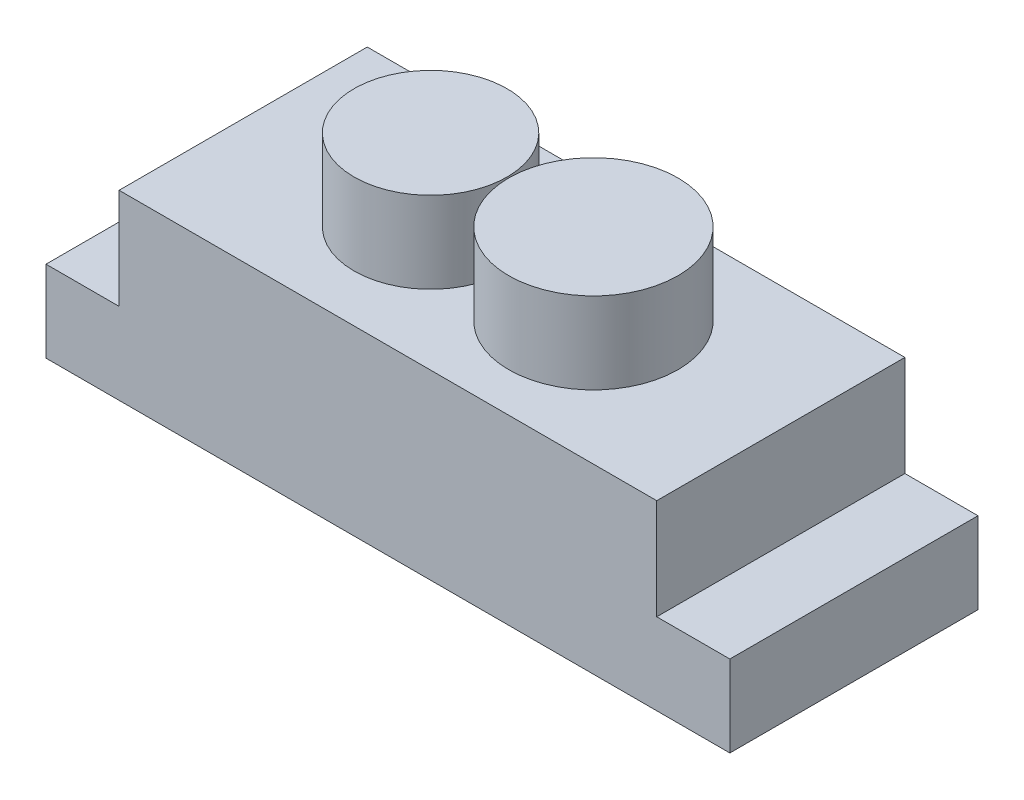
ISO-10303-21;
HEADER;
FILE_DESCRIPTION(('STEP AP214'),'2;1');
FILE_NAME('part.step','',(''),(''),'','','');
FILE_SCHEMA(('AUTOMOTIVE_DESIGN { 1 0 10303 214 1 1 1 1 }'));
ENDSEC;
DATA;
#1=APPLICATION_CONTEXT('core data for automotive mechanical design processes');
#2=APPLICATION_PROTOCOL_DEFINITION('international standard','automotive_design',2000,#1);
#3=PRODUCT_CONTEXT('',#1,'mechanical');
#4=PRODUCT('Part','Part','',(#3));
#5=PRODUCT_RELATED_PRODUCT_CATEGORY('part','',(#4));
#6=PRODUCT_DEFINITION_FORMATION('','',#4);
#7=PRODUCT_DEFINITION_CONTEXT('part definition',#1,'design');
#8=PRODUCT_DEFINITION('design','',#6,#7);
#9=PRODUCT_DEFINITION_SHAPE('','',#8);
#10=(LENGTH_UNIT() NAMED_UNIT(*) SI_UNIT(.MILLI.,.METRE.));
#11=(NAMED_UNIT(*) PLANE_ANGLE_UNIT() SI_UNIT($,.RADIAN.));
#12=(NAMED_UNIT(*) SI_UNIT($,.STERADIAN.) SOLID_ANGLE_UNIT());
#13=UNCERTAINTY_MEASURE_WITH_UNIT(LENGTH_MEASURE(1.E-05),#10,'distance_accuracy_value','');
#14=(GEOMETRIC_REPRESENTATION_CONTEXT(3) GLOBAL_UNCERTAINTY_ASSIGNED_CONTEXT((#13)) GLOBAL_UNIT_ASSIGNED_CONTEXT((#10,
#11,#12)) REPRESENTATION_CONTEXT('',''));
#15=CARTESIAN_POINT('',(0.,0.,0.));
#16=DIRECTION('',(0.,0.,1.));
#17=DIRECTION('',(1.,0.,0.));
#18=AXIS2_PLACEMENT_3D('',#15,#16,#17);
#19=CARTESIAN_POINT('',(-16.51,11.176,7.62));
#20=DIRECTION('',(1.,0.,0.));
#21=DIRECTION('',(0.,0.,-1.));
#22=AXIS2_PLACEMENT_3D('',#19,#20,#21);
#23=PLANE('',#22);
#24=DIRECTION('',(0.,0.,-1.));
#25=VECTOR('',#24,1.);
#26=CARTESIAN_POINT('',(-16.51,5.,7.62));
#27=LINE('',#26,#25);
#28=CARTESIAN_POINT('',(-16.51,5.,7.62));
#29=VERTEX_POINT('',#28);
#30=CARTESIAN_POINT('',(-16.51,5.,-7.62));
#31=VERTEX_POINT('',#30);
#32=EDGE_CURVE('E54',#29,#31,#27,.T.);
#33=ORIENTED_EDGE('',*,*,#32,.F.);
#34=DIRECTION('',(0.,-1.,0.));
#35=VECTOR('',#34,1.);
#36=CARTESIAN_POINT('',(-16.51,11.176,7.62));
#37=LINE('',#36,#35);
#38=CARTESIAN_POINT('',(-16.51,11.176,7.62));
#39=VERTEX_POINT('',#38);
#40=EDGE_CURVE('E11',#39,#29,#37,.T.);
#41=ORIENTED_EDGE('',*,*,#40,.F.);
#42=DIRECTION('',(0.,0.,1.));
#43=VECTOR('',#42,1.);
#44=CARTESIAN_POINT('',(-16.51,11.176,7.62));
#45=LINE('',#44,#43);
#46=CARTESIAN_POINT('',(-16.51,11.176,-7.62));
#47=VERTEX_POINT('',#46);
#48=EDGE_CURVE('E180',#47,#39,#45,.T.);
#49=ORIENTED_EDGE('',*,*,#48,.F.);
#50=DIRECTION('',(0.,-1.,0.));
#51=VECTOR('',#50,1.);
#52=CARTESIAN_POINT('',(-16.51,11.176,-7.62));
#53=LINE('',#52,#51);
#54=EDGE_CURVE('E193',#47,#31,#53,.T.);
#55=ORIENTED_EDGE('',*,*,#54,.T.);
#56=EDGE_LOOP('',(#33,#41,#49,#55));
#57=FACE_BOUND('',#56,.T.);
#58=ADVANCED_FACE('F39',(#57),#23,.F.);
#59=CARTESIAN_POINT('',(16.51,11.176,7.62));
#60=DIRECTION('',(-1.,0.,0.));
#61=DIRECTION('',(0.,0.,1.));
#62=AXIS2_PLACEMENT_3D('',#59,#60,#61);
#63=PLANE('',#62);
#64=DIRECTION('',(0.,0.,1.));
#65=VECTOR('',#64,1.);
#66=CARTESIAN_POINT('',(16.51,5.,7.62));
#67=LINE('',#66,#65);
#68=CARTESIAN_POINT('',(16.51,5.,-7.62));
#69=VERTEX_POINT('',#68);
#70=CARTESIAN_POINT('',(16.51,5.,7.62));
#71=VERTEX_POINT('',#70);
#72=EDGE_CURVE('E152',#69,#71,#67,.T.);
#73=ORIENTED_EDGE('',*,*,#72,.F.);
#74=DIRECTION('',(0.,-1.,0.));
#75=VECTOR('',#74,1.);
#76=CARTESIAN_POINT('',(16.51,11.176,-7.62));
#77=LINE('',#76,#75);
#78=CARTESIAN_POINT('',(16.51,11.176,-7.62));
#79=VERTEX_POINT('',#78);
#80=EDGE_CURVE('E200',#79,#69,#77,.T.);
#81=ORIENTED_EDGE('',*,*,#80,.F.);
#82=DIRECTION('',(0.,0.,-1.));
#83=VECTOR('',#82,1.);
#84=CARTESIAN_POINT('',(16.51,11.176,7.62));
#85=LINE('',#84,#83);
#86=CARTESIAN_POINT('',(16.51,11.176,7.62));
#87=VERTEX_POINT('',#86);
#88=EDGE_CURVE('E187',#87,#79,#85,.T.);
#89=ORIENTED_EDGE('',*,*,#88,.F.);
#90=DIRECTION('',(0.,-1.,0.));
#91=VECTOR('',#90,1.);
#92=CARTESIAN_POINT('',(16.51,11.176,7.62));
#93=LINE('',#92,#91);
#94=EDGE_CURVE('E47',#87,#71,#93,.T.);
#95=ORIENTED_EDGE('',*,*,#94,.T.);
#96=EDGE_LOOP('',(#73,#81,#89,#95));
#97=FACE_BOUND('',#96,.T.);
#98=ADVANCED_FACE('F223',(#97),#63,.F.);
#99=CARTESIAN_POINT('',(16.51,11.176,7.62));
#100=DIRECTION('',(0.,0.,-1.));
#101=DIRECTION('',(-1.,0.,0.));
#102=AXIS2_PLACEMENT_3D('',#99,#100,#101);
#103=PLANE('',#102);
#104=DIRECTION('',(1.,0.,0.));
#105=VECTOR('',#104,1.);
#106=CARTESIAN_POINT('',(16.51,0.,7.62));
#107=LINE('',#106,#105);
#108=CARTESIAN_POINT('',(-21.,0.,7.62));
#109=VERTEX_POINT('',#108);
#110=CARTESIAN_POINT('',(21.,0.,7.62));
#111=VERTEX_POINT('',#110);
#112=EDGE_CURVE('E176',#109,#111,#107,.T.);
#113=ORIENTED_EDGE('',*,*,#112,.T.);
#114=DIRECTION('',(0.,-1.,0.));
#115=VECTOR('',#114,1.);
#116=CARTESIAN_POINT('',(21.,5.,7.62));
#117=LINE('',#116,#115);
#118=CARTESIAN_POINT('',(21.,5.,7.62));
#119=VERTEX_POINT('',#118);
#120=EDGE_CURVE('E153',#119,#111,#117,.T.);
#121=ORIENTED_EDGE('',*,*,#120,.F.);
#122=DIRECTION('',(-1.,0.,0.));
#123=VECTOR('',#122,1.);
#124=CARTESIAN_POINT('',(21.,5.,7.62));
#125=LINE('',#124,#123);
#126=EDGE_CURVE('E117',#119,#71,#125,.T.);
#127=ORIENTED_EDGE('',*,*,#126,.T.);
#128=ORIENTED_EDGE('',*,*,#94,.F.);
#129=DIRECTION('',(1.,0.,0.));
#130=VECTOR('',#129,1.);
#131=CARTESIAN_POINT('',(16.51,11.176,7.62));
#132=LINE('',#131,#130);
#133=EDGE_CURVE('E184',#39,#87,#132,.T.);
#134=ORIENTED_EDGE('',*,*,#133,.F.);
#135=ORIENTED_EDGE('',*,*,#40,.T.);
#136=CARTESIAN_POINT('',(-21.,5.,7.62));
#137=VERTEX_POINT('',#136);
#138=EDGE_CURVE('E144',#29,#137,#125,.T.);
#139=ORIENTED_EDGE('',*,*,#138,.T.);
#140=DIRECTION('',(0.,-1.,0.));
#141=VECTOR('',#140,1.);
#142=CARTESIAN_POINT('',(-21.,5.,7.62));
#143=LINE('',#142,#141);
#144=EDGE_CURVE('E131',#137,#109,#143,.T.);
#145=ORIENTED_EDGE('',*,*,#144,.T.);
#146=EDGE_LOOP('',(#113,#121,#127,#128,#134,#135,#139,#145));
#147=FACE_BOUND('',#146,.T.);
#148=ADVANCED_FACE('F206',(#147),#103,.F.);
#149=CARTESIAN_POINT('',(16.51,11.176,-7.62));
#150=DIRECTION('',(0.,0.,1.));
#151=DIRECTION('',(1.,0.,0.));
#152=AXIS2_PLACEMENT_3D('',#149,#150,#151);
#153=PLANE('',#152);
#154=DIRECTION('',(-1.,0.,0.));
#155=VECTOR('',#154,1.);
#156=CARTESIAN_POINT('',(16.51,0.,-7.62));
#157=LINE('',#156,#155);
#158=CARTESIAN_POINT('',(21.,0.,-7.62));
#159=VERTEX_POINT('',#158);
#160=CARTESIAN_POINT('',(-21.,0.,-7.62));
#161=VERTEX_POINT('',#160);
#162=EDGE_CURVE('E110',#159,#161,#157,.T.);
#163=ORIENTED_EDGE('',*,*,#162,.T.);
#164=DIRECTION('',(0.,-1.,0.));
#165=VECTOR('',#164,1.);
#166=CARTESIAN_POINT('',(-21.,5.,-7.62));
#167=LINE('',#166,#165);
#168=CARTESIAN_POINT('',(-21.,5.,-7.62));
#169=VERTEX_POINT('',#168);
#170=EDGE_CURVE('E104',#169,#161,#167,.T.);
#171=ORIENTED_EDGE('',*,*,#170,.F.);
#172=DIRECTION('',(1.,0.,0.));
#173=VECTOR('',#172,1.);
#174=CARTESIAN_POINT('',(21.,5.,-7.62));
#175=LINE('',#174,#173);
#176=EDGE_CURVE('E108',#169,#31,#175,.T.);
#177=ORIENTED_EDGE('',*,*,#176,.T.);
#178=ORIENTED_EDGE('',*,*,#54,.F.);
#179=DIRECTION('',(-1.,0.,0.));
#180=VECTOR('',#179,1.);
#181=CARTESIAN_POINT('',(16.51,11.176,-7.62));
#182=LINE('',#181,#180);
#183=EDGE_CURVE('E190',#79,#47,#182,.T.);
#184=ORIENTED_EDGE('',*,*,#183,.F.);
#185=ORIENTED_EDGE('',*,*,#80,.T.);
#186=CARTESIAN_POINT('',(21.,5.,-7.62));
#187=VERTEX_POINT('',#186);
#188=EDGE_CURVE('E126',#69,#187,#175,.T.);
#189=ORIENTED_EDGE('',*,*,#188,.T.);
#190=DIRECTION('',(0.,-1.,0.));
#191=VECTOR('',#190,1.);
#192=CARTESIAN_POINT('',(21.,5.,-7.62));
#193=LINE('',#192,#191);
#194=EDGE_CURVE('E116',#187,#159,#193,.T.);
#195=ORIENTED_EDGE('',*,*,#194,.T.);
#196=EDGE_LOOP('',(#163,#171,#177,#178,#184,#185,#189,#195));
#197=FACE_BOUND('',#196,.T.);
#198=ADVANCED_FACE('F106',(#197),#153,.F.);
#199=CARTESIAN_POINT('',(0.,11.176,0.));
#200=DIRECTION('',(0.,1.,0.));
#201=DIRECTION('',(0.,0.,1.));
#202=AXIS2_PLACEMENT_3D('',#199,#200,#201);
#203=PLANE('',#202);
#204=CARTESIAN_POINT('',(5.,11.176,0.));
#205=DIRECTION('',(0.,1.,0.));
#206=DIRECTION('',(0.,0.,1.));
#207=AXIS2_PLACEMENT_3D('',#204,#205,#206);
#208=CIRCLE('',#207,5.2);
#209=CARTESIAN_POINT('',(5.,11.176,5.2));
#210=VERTEX_POINT('',#209);
#211=EDGE_CURVE('E163',#210,#210,#208,.T.);
#212=ORIENTED_EDGE('',*,*,#211,.F.);
#213=EDGE_LOOP('',(#212));
#214=FACE_BOUND('',#213,.T.);
#215=CARTESIAN_POINT('',(-5.,11.176,0.));
#216=DIRECTION('',(0.,1.,0.));
#217=DIRECTION('',(0.,0.,1.));
#218=AXIS2_PLACEMENT_3D('',#215,#216,#217);
#219=CIRCLE('',#218,4.7);
#220=CARTESIAN_POINT('',(-5.,11.176,4.7));
#221=VERTEX_POINT('',#220);
#222=EDGE_CURVE('E168',#221,#221,#219,.T.);
#223=ORIENTED_EDGE('',*,*,#222,.F.);
#224=EDGE_LOOP('',(#223));
#225=FACE_BOUND('',#224,.T.);
#226=ORIENTED_EDGE('',*,*,#48,.T.);
#227=ORIENTED_EDGE('',*,*,#133,.T.);
#228=ORIENTED_EDGE('',*,*,#88,.T.);
#229=ORIENTED_EDGE('',*,*,#183,.T.);
#230=EDGE_LOOP('',(#226,#227,#228,#229));
#231=FACE_BOUND('',#230,.T.);
#232=ADVANCED_FACE('F209',(#214,#225,#231),#203,.T.);
#233=CARTESIAN_POINT('',(0.,0.,0.));
#234=DIRECTION('',(0.,1.,0.));
#235=DIRECTION('',(0.,0.,1.));
#236=AXIS2_PLACEMENT_3D('',#233,#234,#235);
#237=PLANE('',#236);
#238=ORIENTED_EDGE('',*,*,#112,.F.);
#239=DIRECTION('',(0.,0.,-1.));
#240=VECTOR('',#239,1.);
#241=CARTESIAN_POINT('',(-21.,0.,-7.62));
#242=LINE('',#241,#240);
#243=EDGE_CURVE('E138',#109,#161,#242,.T.);
#244=ORIENTED_EDGE('',*,*,#243,.T.);
#245=ORIENTED_EDGE('',*,*,#162,.F.);
#246=DIRECTION('',(0.,0.,1.));
#247=VECTOR('',#246,1.);
#248=CARTESIAN_POINT('',(21.,0.,-7.62));
#249=LINE('',#248,#247);
#250=EDGE_CURVE('E133',#159,#111,#249,.T.);
#251=ORIENTED_EDGE('',*,*,#250,.T.);
#252=EDGE_LOOP('',(#238,#244,#245,#251));
#253=FACE_BOUND('',#252,.T.);
#254=ADVANCED_FACE('F222',(#253),#237,.F.);
#255=CARTESIAN_POINT('',(-5.,16.176,0.));
#256=DIRECTION('',(0.,-1.,0.));
#257=DIRECTION('',(0.,0.,-1.));
#258=AXIS2_PLACEMENT_3D('',#255,#256,#257);
#259=CYLINDRICAL_SURFACE('',#258,4.7);
#260=CARTESIAN_POINT('',(-5.,16.176,0.));
#261=DIRECTION('',(0.,1.,0.));
#262=DIRECTION('',(0.,0.,1.));
#263=AXIS2_PLACEMENT_3D('',#260,#261,#262);
#264=CIRCLE('',#263,4.7);
#265=CARTESIAN_POINT('',(-5.,16.176,4.7));
#266=VERTEX_POINT('',#265);
#267=EDGE_CURVE('E172',#266,#266,#264,.T.);
#268=ORIENTED_EDGE('',*,*,#267,.F.);
#269=EDGE_LOOP('',(#268));
#270=FACE_BOUND('',#269,.T.);
#271=ORIENTED_EDGE('',*,*,#222,.T.);
#272=EDGE_LOOP('',(#271));
#273=FACE_BOUND('',#272,.T.);
#274=ADVANCED_FACE('F235',(#270,#273),#259,.T.);
#275=CARTESIAN_POINT('',(-5.,16.176,0.));
#276=DIRECTION('',(0.,1.,0.));
#277=DIRECTION('',(0.,0.,1.));
#278=AXIS2_PLACEMENT_3D('',#275,#276,#277);
#279=PLANE('',#278);
#280=ORIENTED_EDGE('',*,*,#267,.T.);
#281=EDGE_LOOP('',(#280));
#282=FACE_BOUND('',#281,.T.);
#283=ADVANCED_FACE('F241',(#282),#279,.T.);
#284=CARTESIAN_POINT('',(5.,16.176,0.));
#285=DIRECTION('',(0.,-1.,0.));
#286=DIRECTION('',(0.,0.,-1.));
#287=AXIS2_PLACEMENT_3D('',#284,#285,#286);
#288=CYLINDRICAL_SURFACE('',#287,5.2);
#289=CARTESIAN_POINT('',(5.,16.176,0.));
#290=DIRECTION('',(0.,1.,0.));
#291=DIRECTION('',(0.,0.,1.));
#292=AXIS2_PLACEMENT_3D('',#289,#290,#291);
#293=CIRCLE('',#292,5.2);
#294=CARTESIAN_POINT('',(5.,16.176,5.2));
#295=VERTEX_POINT('',#294);
#296=EDGE_CURVE('E164',#295,#295,#293,.T.);
#297=ORIENTED_EDGE('',*,*,#296,.F.);
#298=EDGE_LOOP('',(#297));
#299=FACE_BOUND('',#298,.T.);
#300=ORIENTED_EDGE('',*,*,#211,.T.);
#301=EDGE_LOOP('',(#300));
#302=FACE_BOUND('',#301,.T.);
#303=ADVANCED_FACE('F245',(#299,#302),#288,.T.);
#304=CARTESIAN_POINT('',(5.,16.176,0.));
#305=DIRECTION('',(0.,1.,0.));
#306=DIRECTION('',(0.,0.,1.));
#307=AXIS2_PLACEMENT_3D('',#304,#305,#306);
#308=PLANE('',#307);
#309=ORIENTED_EDGE('',*,*,#296,.T.);
#310=EDGE_LOOP('',(#309));
#311=FACE_BOUND('',#310,.T.);
#312=ADVANCED_FACE('F249',(#311),#308,.T.);
#313=CARTESIAN_POINT('',(21.,5.,-7.62));
#314=DIRECTION('',(1.,0.,0.));
#315=DIRECTION('',(0.,0.,-1.));
#316=AXIS2_PLACEMENT_3D('',#313,#314,#315);
#317=PLANE('',#316);
#318=ORIENTED_EDGE('',*,*,#250,.F.);
#319=ORIENTED_EDGE('',*,*,#194,.F.);
#320=DIRECTION('',(0.,0.,1.));
#321=VECTOR('',#320,1.);
#322=CARTESIAN_POINT('',(21.,5.,-7.62));
#323=LINE('',#322,#321);
#324=EDGE_CURVE('E125',#187,#119,#323,.T.);
#325=ORIENTED_EDGE('',*,*,#324,.T.);
#326=ORIENTED_EDGE('',*,*,#120,.T.);
#327=EDGE_LOOP('',(#318,#319,#325,#326));
#328=FACE_BOUND('',#327,.T.);
#329=ADVANCED_FACE('F220',(#328),#317,.T.);
#330=CARTESIAN_POINT('',(0.,5.,0.));
#331=DIRECTION('',(0.,-1.,0.));
#332=DIRECTION('',(0.,0.,-1.));
#333=AXIS2_PLACEMENT_3D('',#330,#331,#332);
#334=PLANE('',#333);
#335=ORIENTED_EDGE('',*,*,#188,.F.);
#336=ORIENTED_EDGE('',*,*,#72,.T.);
#337=ORIENTED_EDGE('',*,*,#126,.F.);
#338=ORIENTED_EDGE('',*,*,#324,.F.);
#339=EDGE_LOOP('',(#335,#336,#337,#338));
#340=FACE_BOUND('',#339,.T.);
#341=ADVANCED_FACE('F216',(#340),#334,.F.);
#342=ORIENTED_EDGE('',*,*,#138,.F.);
#343=ORIENTED_EDGE('',*,*,#32,.T.);
#344=ORIENTED_EDGE('',*,*,#176,.F.);
#345=DIRECTION('',(0.,0.,-1.));
#346=VECTOR('',#345,1.);
#347=CARTESIAN_POINT('',(-21.,5.,-7.62));
#348=LINE('',#347,#346);
#349=EDGE_CURVE('E123',#137,#169,#348,.T.);
#350=ORIENTED_EDGE('',*,*,#349,.F.);
#351=EDGE_LOOP('',(#342,#343,#344,#350));
#352=FACE_BOUND('',#351,.T.);
#353=ADVANCED_FACE('F122',(#352),#334,.F.);
#354=CARTESIAN_POINT('',(-21.,5.,-7.62));
#355=DIRECTION('',(-1.,0.,0.));
#356=DIRECTION('',(0.,0.,1.));
#357=AXIS2_PLACEMENT_3D('',#354,#355,#356);
#358=PLANE('',#357);
#359=ORIENTED_EDGE('',*,*,#243,.F.);
#360=ORIENTED_EDGE('',*,*,#144,.F.);
#361=ORIENTED_EDGE('',*,*,#349,.T.);
#362=ORIENTED_EDGE('',*,*,#170,.T.);
#363=EDGE_LOOP('',(#359,#360,#361,#362));
#364=FACE_BOUND('',#363,.T.);
#365=ADVANCED_FACE('F129',(#364),#358,.T.);
#366=CLOSED_SHELL('',(#58,#98,#148,#198,#232,#254,#274,#283,#303,#312,#329,#341,#353,#365));
#367=MANIFOLD_SOLID_BREP('B2',#366);
#368=ADVANCED_BREP_SHAPE_REPRESENTATION('',(#18,#367),#14);
#369=SHAPE_DEFINITION_REPRESENTATION(#9,#368);
ENDSEC;
END-ISO-10303-21;
